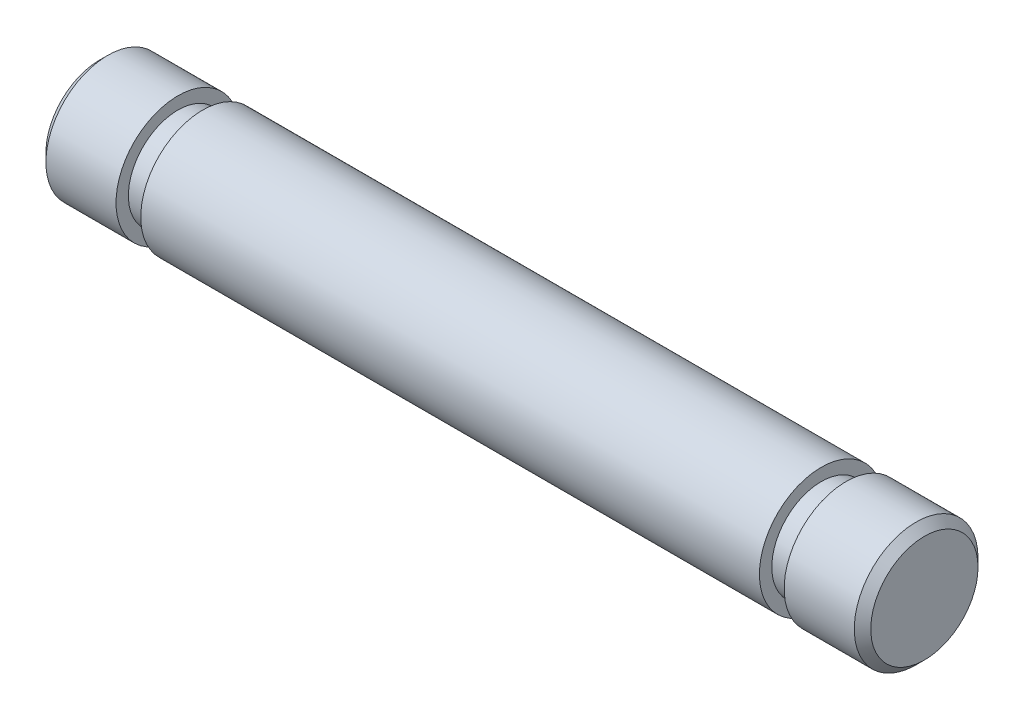
ISO-10303-21;
HEADER;
FILE_DESCRIPTION(('STEP AP214'),'2;1');
FILE_NAME('part.step','',(''),(''),'','','');
FILE_SCHEMA(('AUTOMOTIVE_DESIGN { 1 0 10303 214 1 1 1 1 }'));
ENDSEC;
DATA;
#1=APPLICATION_CONTEXT('core data for automotive mechanical design processes');
#2=APPLICATION_PROTOCOL_DEFINITION('international standard','automotive_design',2000,#1);
#3=PRODUCT_CONTEXT('',#1,'mechanical');
#4=PRODUCT('Part','Part','',(#3));
#5=PRODUCT_RELATED_PRODUCT_CATEGORY('part','',(#4));
#6=PRODUCT_DEFINITION_FORMATION('','',#4);
#7=PRODUCT_DEFINITION_CONTEXT('part definition',#1,'design');
#8=PRODUCT_DEFINITION('design','',#6,#7);
#9=PRODUCT_DEFINITION_SHAPE('','',#8);
#10=(LENGTH_UNIT() NAMED_UNIT(*) SI_UNIT(.MILLI.,.METRE.));
#11=(NAMED_UNIT(*) PLANE_ANGLE_UNIT() SI_UNIT($,.RADIAN.));
#12=(NAMED_UNIT(*) SI_UNIT($,.STERADIAN.) SOLID_ANGLE_UNIT());
#13=UNCERTAINTY_MEASURE_WITH_UNIT(LENGTH_MEASURE(1.E-05),#10,'distance_accuracy_value','');
#14=(GEOMETRIC_REPRESENTATION_CONTEXT(3) GLOBAL_UNCERTAINTY_ASSIGNED_CONTEXT((#13)) GLOBAL_UNIT_ASSIGNED_CONTEXT((#10,
#11,#12)) REPRESENTATION_CONTEXT('',''));
#15=CARTESIAN_POINT('',(0.,0.,0.));
#16=DIRECTION('',(0.,0.,1.));
#17=DIRECTION('',(1.,0.,0.));
#18=AXIS2_PLACEMENT_3D('',#15,#16,#17);
#19=CARTESIAN_POINT('',(10.,0.,0.));
#20=DIRECTION('',(-1.,0.,0.));
#21=DIRECTION('',(0.,0.,1.));
#22=AXIS2_PLACEMENT_3D('',#19,#20,#21);
#23=CYLINDRICAL_SURFACE('',#22,1.5);
#24=CARTESIAN_POINT('',(-9.8,0.,0.));
#25=DIRECTION('',(1.,0.,0.));
#26=DIRECTION('',(0.,0.,-1.));
#27=AXIS2_PLACEMENT_3D('',#24,#25,#26);
#28=CIRCLE('',#27,1.5);
#29=CARTESIAN_POINT('',(-9.8,0.,-1.5));
#30=VERTEX_POINT('',#29);
#31=EDGE_CURVE('E41',#30,#30,#28,.T.);
#32=ORIENTED_EDGE('',*,*,#31,.T.);
#33=EDGE_LOOP('',(#32));
#34=FACE_BOUND('',#33,.T.);
#35=CARTESIAN_POINT('',(-8.1,0.,0.));
#36=DIRECTION('',(1.,0.,0.));
#37=DIRECTION('',(0.,0.,-1.));
#38=AXIS2_PLACEMENT_3D('',#35,#36,#37);
#39=CIRCLE('',#38,1.5);
#40=CARTESIAN_POINT('',(-8.1,0.,-1.5));
#41=VERTEX_POINT('',#40);
#42=EDGE_CURVE('E54',#41,#41,#39,.T.);
#43=ORIENTED_EDGE('',*,*,#42,.F.);
#44=EDGE_LOOP('',(#43));
#45=FACE_BOUND('',#44,.T.);
#46=ADVANCED_FACE('F33',(#34,#45),#23,.T.);
#47=CARTESIAN_POINT('',(-10.,0.,0.));
#48=DIRECTION('',(1.,0.,0.));
#49=DIRECTION('',(0.,0.,-1.));
#50=AXIS2_PLACEMENT_3D('',#47,#48,#49);
#51=PLANE('',#50);
#52=CARTESIAN_POINT('',(-10.,0.,0.));
#53=DIRECTION('',(1.,0.,0.));
#54=DIRECTION('',(0.,0.,-1.));
#55=AXIS2_PLACEMENT_3D('',#52,#53,#54);
#56=CIRCLE('',#55,1.3);
#57=CARTESIAN_POINT('',(-10.,0.,-1.3));
#58=VERTEX_POINT('',#57);
#59=EDGE_CURVE('E10',#58,#58,#56,.F.);
#60=ORIENTED_EDGE('',*,*,#59,.T.);
#61=EDGE_LOOP('',(#60));
#62=FACE_BOUND('',#61,.T.);
#63=ADVANCED_FACE('F100',(#62),#51,.F.);
#64=CARTESIAN_POINT('',(-8.1,0.,0.));
#65=DIRECTION('',(1.,0.,0.));
#66=DIRECTION('',(0.,0.,-1.));
#67=AXIS2_PLACEMENT_3D('',#64,#65,#66);
#68=PLANE('',#67);
#69=CARTESIAN_POINT('',(-8.1,0.,0.));
#70=DIRECTION('',(1.,0.,0.));
#71=DIRECTION('',(0.,0.,-1.));
#72=AXIS2_PLACEMENT_3D('',#69,#70,#71);
#73=CIRCLE('',#72,1.2);
#74=CARTESIAN_POINT('',(-8.1,0.,-1.2));
#75=VERTEX_POINT('',#74);
#76=EDGE_CURVE('E58',#75,#75,#73,.T.);
#77=ORIENTED_EDGE('',*,*,#76,.F.);
#78=EDGE_LOOP('',(#77));
#79=FACE_BOUND('',#78,.T.);
#80=ORIENTED_EDGE('',*,*,#42,.T.);
#81=EDGE_LOOP('',(#80));
#82=FACE_BOUND('',#81,.T.);
#83=ADVANCED_FACE('F106',(#79,#82),#68,.T.);
#84=CARTESIAN_POINT('',(-7.5,0.,0.));
#85=DIRECTION('',(1.,0.,0.));
#86=DIRECTION('',(0.,0.,-1.));
#87=AXIS2_PLACEMENT_3D('',#84,#85,#86);
#88=PLANE('',#87);
#89=CARTESIAN_POINT('',(-7.5,0.,0.));
#90=DIRECTION('',(1.,0.,0.));
#91=DIRECTION('',(0.,0.,-1.));
#92=AXIS2_PLACEMENT_3D('',#89,#90,#91);
#93=CIRCLE('',#92,1.2);
#94=CARTESIAN_POINT('',(-7.5,0.,-1.2));
#95=VERTEX_POINT('',#94);
#96=EDGE_CURVE('E61',#95,#95,#93,.T.);
#97=ORIENTED_EDGE('',*,*,#96,.T.);
#98=EDGE_LOOP('',(#97));
#99=FACE_BOUND('',#98,.T.);
#100=CARTESIAN_POINT('',(-7.5,0.,0.));
#101=DIRECTION('',(1.,0.,0.));
#102=DIRECTION('',(0.,0.,-1.));
#103=AXIS2_PLACEMENT_3D('',#100,#101,#102);
#104=CIRCLE('',#103,1.5);
#105=CARTESIAN_POINT('',(-7.5,0.,-1.5));
#106=VERTEX_POINT('',#105);
#107=EDGE_CURVE('E55',#106,#106,#104,.T.);
#108=ORIENTED_EDGE('',*,*,#107,.F.);
#109=EDGE_LOOP('',(#108));
#110=FACE_BOUND('',#109,.T.);
#111=ADVANCED_FACE('F130',(#99,#110),#88,.F.);
#112=CARTESIAN_POINT('',(-8.1,0.,0.));
#113=DIRECTION('',(1.,0.,0.));
#114=DIRECTION('',(0.,0.,-1.));
#115=AXIS2_PLACEMENT_3D('',#112,#113,#114);
#116=CYLINDRICAL_SURFACE('',#115,1.2);
#117=ORIENTED_EDGE('',*,*,#76,.T.);
#118=EDGE_LOOP('',(#117));
#119=FACE_BOUND('',#118,.T.);
#120=ORIENTED_EDGE('',*,*,#96,.F.);
#121=EDGE_LOOP('',(#120));
#122=FACE_BOUND('',#121,.T.);
#123=ADVANCED_FACE('F110',(#119,#122),#116,.T.);
#124=CARTESIAN_POINT('',(7.5,0.,0.));
#125=DIRECTION('',(1.,0.,0.));
#126=DIRECTION('',(0.,0.,-1.));
#127=AXIS2_PLACEMENT_3D('',#124,#125,#126);
#128=CIRCLE('',#127,1.5);
#129=CARTESIAN_POINT('',(7.5,0.,-1.5));
#130=VERTEX_POINT('',#129);
#131=EDGE_CURVE('E67',#130,#130,#128,.T.);
#132=ORIENTED_EDGE('',*,*,#131,.F.);
#133=EDGE_LOOP('',(#132));
#134=FACE_BOUND('',#133,.T.);
#135=ORIENTED_EDGE('',*,*,#107,.T.);
#136=EDGE_LOOP('',(#135));
#137=FACE_BOUND('',#136,.T.);
#138=ADVANCED_FACE('F95',(#134,#137),#23,.T.);
#139=CARTESIAN_POINT('',(8.1,0.,0.));
#140=DIRECTION('',(-1.,0.,0.));
#141=DIRECTION('',(0.,0.,-1.));
#142=AXIS2_PLACEMENT_3D('',#139,#140,#141);
#143=PLANE('',#142);
#144=CARTESIAN_POINT('',(8.1,0.,0.));
#145=DIRECTION('',(1.,0.,0.));
#146=DIRECTION('',(0.,0.,-1.));
#147=AXIS2_PLACEMENT_3D('',#144,#145,#146);
#148=CIRCLE('',#147,1.5);
#149=CARTESIAN_POINT('',(8.1,0.,-1.5));
#150=VERTEX_POINT('',#149);
#151=EDGE_CURVE('E64',#150,#150,#148,.T.);
#152=ORIENTED_EDGE('',*,*,#151,.F.);
#153=EDGE_LOOP('',(#152));
#154=FACE_BOUND('',#153,.T.);
#155=CARTESIAN_POINT('',(8.1,0.,0.));
#156=DIRECTION('',(1.,0.,0.));
#157=DIRECTION('',(0.,0.,-1.));
#158=AXIS2_PLACEMENT_3D('',#155,#156,#157);
#159=CIRCLE('',#158,1.2);
#160=CARTESIAN_POINT('',(8.1,0.,-1.2));
#161=VERTEX_POINT('',#160);
#162=EDGE_CURVE('E70',#161,#161,#159,.T.);
#163=ORIENTED_EDGE('',*,*,#162,.T.);
#164=EDGE_LOOP('',(#163));
#165=FACE_BOUND('',#164,.T.);
#166=ADVANCED_FACE('F79',(#154,#165),#143,.T.);
#167=CARTESIAN_POINT('',(7.5,0.,0.));
#168=DIRECTION('',(-1.,0.,0.));
#169=DIRECTION('',(0.,0.,-1.));
#170=AXIS2_PLACEMENT_3D('',#167,#168,#169);
#171=PLANE('',#170);
#172=ORIENTED_EDGE('',*,*,#131,.T.);
#173=EDGE_LOOP('',(#172));
#174=FACE_BOUND('',#173,.T.);
#175=CARTESIAN_POINT('',(7.5,0.,0.));
#176=DIRECTION('',(1.,0.,0.));
#177=DIRECTION('',(0.,0.,-1.));
#178=AXIS2_PLACEMENT_3D('',#175,#176,#177);
#179=CIRCLE('',#178,1.2);
#180=CARTESIAN_POINT('',(7.5,0.,-1.2));
#181=VERTEX_POINT('',#180);
#182=EDGE_CURVE('E73',#181,#181,#179,.T.);
#183=ORIENTED_EDGE('',*,*,#182,.F.);
#184=EDGE_LOOP('',(#183));
#185=FACE_BOUND('',#184,.T.);
#186=ADVANCED_FACE('F85',(#174,#185),#171,.F.);
#187=CARTESIAN_POINT('',(8.1,0.,0.));
#188=DIRECTION('',(-1.,0.,0.));
#189=DIRECTION('',(0.,0.,1.));
#190=AXIS2_PLACEMENT_3D('',#187,#188,#189);
#191=CYLINDRICAL_SURFACE('',#190,1.2);
#192=ORIENTED_EDGE('',*,*,#162,.F.);
#193=EDGE_LOOP('',(#192));
#194=FACE_BOUND('',#193,.T.);
#195=ORIENTED_EDGE('',*,*,#182,.T.);
#196=EDGE_LOOP('',(#195));
#197=FACE_BOUND('',#196,.T.);
#198=ADVANCED_FACE('F81',(#194,#197),#191,.T.);
#199=CARTESIAN_POINT('',(10.,0.,0.));
#200=DIRECTION('',(1.,0.,0.));
#201=DIRECTION('',(0.,0.,-1.));
#202=AXIS2_PLACEMENT_3D('',#199,#200,#201);
#203=PLANE('',#202);
#204=CARTESIAN_POINT('',(10.,0.,0.));
#205=DIRECTION('',(1.,0.,0.));
#206=DIRECTION('',(0.,0.,-1.));
#207=AXIS2_PLACEMENT_3D('',#204,#205,#206);
#208=CIRCLE('',#207,1.30000000000001);
#209=CARTESIAN_POINT('',(10.,0.,-1.30000000000001));
#210=VERTEX_POINT('',#209);
#211=EDGE_CURVE('E49',#210,#210,#208,.T.);
#212=ORIENTED_EDGE('',*,*,#211,.T.);
#213=EDGE_LOOP('',(#212));
#214=FACE_BOUND('',#213,.T.);
#215=ADVANCED_FACE('F84',(#214),#203,.T.);
#216=CARTESIAN_POINT('',(9.8,0.,0.));
#217=DIRECTION('',(1.,0.,0.));
#218=DIRECTION('',(0.,0.,-1.));
#219=AXIS2_PLACEMENT_3D('',#216,#217,#218);
#220=CIRCLE('',#219,1.5);
#221=CARTESIAN_POINT('',(9.8,0.,-1.5));
#222=VERTEX_POINT('',#221);
#223=EDGE_CURVE('E45',#222,#222,#220,.F.);
#224=ORIENTED_EDGE('',*,*,#223,.T.);
#225=EDGE_LOOP('',(#224));
#226=FACE_BOUND('',#225,.T.);
#227=ORIENTED_EDGE('',*,*,#151,.T.);
#228=EDGE_LOOP('',(#227));
#229=FACE_BOUND('',#228,.T.);
#230=ADVANCED_FACE('F102',(#226,#229),#23,.T.);
#231=CARTESIAN_POINT('',(10.,0.,0.));
#232=DIRECTION('',(-1.,0.,0.));
#233=DIRECTION('',(0.,0.,1.));
#234=AXIS2_PLACEMENT_3D('',#231,#232,#233);
#235=CONICAL_SURFACE('',#234,1.30000000000001,0.785398163397446);
#236=ORIENTED_EDGE('',*,*,#223,.F.);
#237=EDGE_LOOP('',(#236));
#238=FACE_BOUND('',#237,.T.);
#239=ORIENTED_EDGE('',*,*,#211,.F.);
#240=EDGE_LOOP('',(#239));
#241=FACE_BOUND('',#240,.T.);
#242=ADVANCED_FACE('F113',(#238,#241),#235,.T.);
#243=CARTESIAN_POINT('',(-9.8,0.,0.));
#244=DIRECTION('',(1.,0.,0.));
#245=DIRECTION('',(0.,0.,-1.));
#246=AXIS2_PLACEMENT_3D('',#243,#244,#245);
#247=CONICAL_SURFACE('',#246,1.5,0.785398163397446);
#248=ORIENTED_EDGE('',*,*,#59,.F.);
#249=EDGE_LOOP('',(#248));
#250=FACE_BOUND('',#249,.T.);
#251=ORIENTED_EDGE('',*,*,#31,.F.);
#252=EDGE_LOOP('',(#251));
#253=FACE_BOUND('',#252,.T.);
#254=ADVANCED_FACE('F36',(#250,#253),#247,.T.);
#255=CLOSED_SHELL('',(#46,#63,#83,#111,#123,#138,#166,#186,#198,#215,#230,#242,#254));
#256=MANIFOLD_SOLID_BREP('B2',#255);
#257=ADVANCED_BREP_SHAPE_REPRESENTATION('',(#18,#256),#14);
#258=SHAPE_DEFINITION_REPRESENTATION(#9,#257);
ENDSEC;
END-ISO-10303-21;
